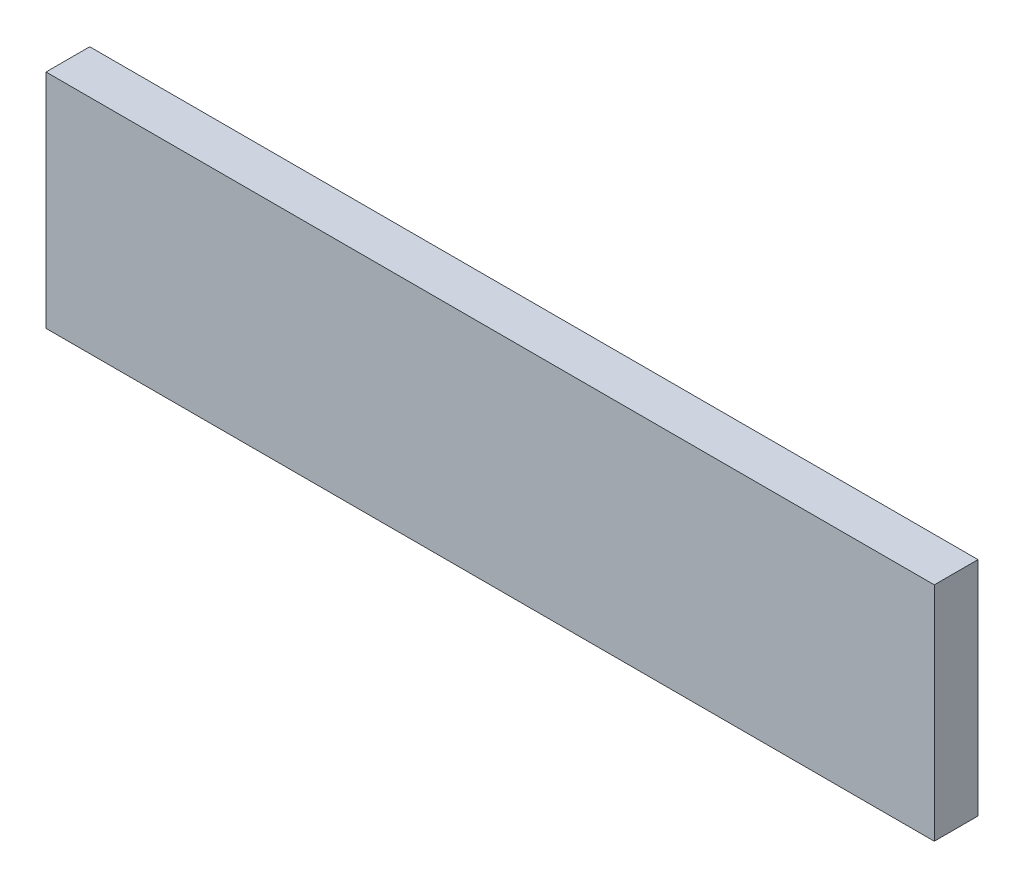
ISO-10303-21;
HEADER;
FILE_DESCRIPTION(('STEP AP214'),'2;1');
FILE_NAME('part.step','',(''),(''),'','','');
FILE_SCHEMA(('AUTOMOTIVE_DESIGN { 1 0 10303 214 1 1 1 1 }'));
ENDSEC;
DATA;
#1=APPLICATION_CONTEXT('core data for automotive mechanical design processes');
#2=APPLICATION_PROTOCOL_DEFINITION('international standard','automotive_design',2000,#1);
#3=PRODUCT_CONTEXT('',#1,'mechanical');
#4=PRODUCT('Part','Part','',(#3));
#5=PRODUCT_RELATED_PRODUCT_CATEGORY('part','',(#4));
#6=PRODUCT_DEFINITION_FORMATION('','',#4);
#7=PRODUCT_DEFINITION_CONTEXT('part definition',#1,'design');
#8=PRODUCT_DEFINITION('design','',#6,#7);
#9=PRODUCT_DEFINITION_SHAPE('','',#8);
#10=(LENGTH_UNIT() NAMED_UNIT(*) SI_UNIT(.MILLI.,.METRE.));
#11=(NAMED_UNIT(*) PLANE_ANGLE_UNIT() SI_UNIT($,.RADIAN.));
#12=(NAMED_UNIT(*) SI_UNIT($,.STERADIAN.) SOLID_ANGLE_UNIT());
#13=UNCERTAINTY_MEASURE_WITH_UNIT(LENGTH_MEASURE(1.E-05),#10,'distance_accuracy_value','');
#14=(GEOMETRIC_REPRESENTATION_CONTEXT(3) GLOBAL_UNCERTAINTY_ASSIGNED_CONTEXT((#13)) GLOBAL_UNIT_ASSIGNED_CONTEXT((#10,
#11,#12)) REPRESENTATION_CONTEXT('',''));
#15=CARTESIAN_POINT('',(0.,0.,0.));
#16=DIRECTION('',(0.,0.,1.));
#17=DIRECTION('',(1.,0.,0.));
#18=AXIS2_PLACEMENT_3D('',#15,#16,#17);
#19=CARTESIAN_POINT('',(-72.4758549021089,34.8924949638558,5.));
#20=DIRECTION('',(1.,0.,0.));
#21=DIRECTION('',(0.,0.,-1.));
#22=AXIS2_PLACEMENT_3D('',#19,#20,#21);
#23=PLANE('',#22);
#24=DIRECTION('',(0.,-1.,0.));
#25=VECTOR('',#24,1.);
#26=CARTESIAN_POINT('',(-72.4758549021089,34.8924949638558,0.));
#27=LINE('',#26,#25);
#28=CARTESIAN_POINT('',(-72.4758549021089,34.8924949638558,0.));
#29=VERTEX_POINT('',#28);
#30=CARTESIAN_POINT('',(-72.4758549021089,9.49249496385583,0.));
#31=VERTEX_POINT('',#30);
#32=EDGE_CURVE('E96',#29,#31,#27,.T.);
#33=ORIENTED_EDGE('',*,*,#32,.T.);
#34=DIRECTION('',(0.,0.,-1.));
#35=VECTOR('',#34,1.);
#36=CARTESIAN_POINT('',(-72.4758549021089,9.49249496385583,5.));
#37=LINE('',#36,#35);
#38=CARTESIAN_POINT('',(-72.4758549021089,9.49249496385583,5.));
#39=VERTEX_POINT('',#38);
#40=EDGE_CURVE('E11',#39,#31,#37,.T.);
#41=ORIENTED_EDGE('',*,*,#40,.F.);
#42=DIRECTION('',(0.,-1.,0.));
#43=VECTOR('',#42,1.);
#44=CARTESIAN_POINT('',(-72.4758549021089,34.8924949638558,5.));
#45=LINE('',#44,#43);
#46=CARTESIAN_POINT('',(-72.4758549021089,34.8924949638558,5.));
#47=VERTEX_POINT('',#46);
#48=EDGE_CURVE('E84',#47,#39,#45,.T.);
#49=ORIENTED_EDGE('',*,*,#48,.F.);
#50=DIRECTION('',(0.,0.,-1.));
#51=VECTOR('',#50,1.);
#52=CARTESIAN_POINT('',(-72.4758549021089,34.8924949638558,5.));
#53=LINE('',#52,#51);
#54=EDGE_CURVE('E92',#47,#29,#53,.T.);
#55=ORIENTED_EDGE('',*,*,#54,.T.);
#56=EDGE_LOOP('',(#33,#41,#49,#55));
#57=FACE_BOUND('',#56,.T.);
#58=ADVANCED_FACE('F33',(#57),#23,.F.);
#59=CARTESIAN_POINT('',(-72.4758549021089,9.49249496385583,5.));
#60=DIRECTION('',(0.,1.,0.));
#61=DIRECTION('',(0.,0.,1.));
#62=AXIS2_PLACEMENT_3D('',#59,#60,#61);
#63=PLANE('',#62);
#64=DIRECTION('',(1.,0.,0.));
#65=VECTOR('',#64,1.);
#66=CARTESIAN_POINT('',(-72.4758549021089,9.49249496385583,0.));
#67=LINE('',#66,#65);
#68=CARTESIAN_POINT('',(29.1241450978911,9.49249496385583,0.));
#69=VERTEX_POINT('',#68);
#70=EDGE_CURVE('E88',#31,#69,#67,.T.);
#71=ORIENTED_EDGE('',*,*,#70,.T.);
#72=DIRECTION('',(0.,0.,-1.));
#73=VECTOR('',#72,1.);
#74=CARTESIAN_POINT('',(29.1241450978911,9.49249496385583,5.));
#75=LINE('',#74,#73);
#76=CARTESIAN_POINT('',(29.1241450978911,9.49249496385583,5.));
#77=VERTEX_POINT('',#76);
#78=EDGE_CURVE('E41',#77,#69,#75,.T.);
#79=ORIENTED_EDGE('',*,*,#78,.F.);
#80=DIRECTION('',(1.,0.,0.));
#81=VECTOR('',#80,1.);
#82=CARTESIAN_POINT('',(-72.4758549021089,9.49249496385583,5.));
#83=LINE('',#82,#81);
#84=EDGE_CURVE('E79',#39,#77,#83,.T.);
#85=ORIENTED_EDGE('',*,*,#84,.F.);
#86=ORIENTED_EDGE('',*,*,#40,.T.);
#87=EDGE_LOOP('',(#71,#79,#85,#86));
#88=FACE_BOUND('',#87,.T.);
#89=ADVANCED_FACE('F87',(#88),#63,.F.);
#90=CARTESIAN_POINT('',(29.124145097891,34.8924949638558,5.));
#91=DIRECTION('',(-1.,0.,0.));
#92=DIRECTION('',(0.,-1.,0.));
#93=AXIS2_PLACEMENT_3D('',#90,#91,#92);
#94=PLANE('',#93);
#95=DIRECTION('',(0.,1.,0.));
#96=VECTOR('',#95,1.);
#97=CARTESIAN_POINT('',(29.124145097891,34.8924949638558,0.));
#98=LINE('',#97,#96);
#99=CARTESIAN_POINT('',(29.124145097891,34.8924949638558,0.));
#100=VERTEX_POINT('',#99);
#101=EDGE_CURVE('E66',#69,#100,#98,.T.);
#102=ORIENTED_EDGE('',*,*,#101,.T.);
#103=DIRECTION('',(0.,0.,-1.));
#104=VECTOR('',#103,1.);
#105=CARTESIAN_POINT('',(29.124145097891,34.8924949638558,5.));
#106=LINE('',#105,#104);
#107=CARTESIAN_POINT('',(29.124145097891,34.8924949638558,5.));
#108=VERTEX_POINT('',#107);
#109=EDGE_CURVE('E89',#108,#100,#106,.T.);
#110=ORIENTED_EDGE('',*,*,#109,.F.);
#111=DIRECTION('',(0.,1.,0.));
#112=VECTOR('',#111,1.);
#113=CARTESIAN_POINT('',(29.124145097891,34.8924949638558,5.));
#114=LINE('',#113,#112);
#115=EDGE_CURVE('E82',#77,#108,#114,.T.);
#116=ORIENTED_EDGE('',*,*,#115,.F.);
#117=ORIENTED_EDGE('',*,*,#78,.T.);
#118=EDGE_LOOP('',(#102,#110,#116,#117));
#119=FACE_BOUND('',#118,.T.);
#120=ADVANCED_FACE('F90',(#119),#94,.F.);
#121=CARTESIAN_POINT('',(-72.4758549021089,34.8924949638558,5.));
#122=DIRECTION('',(0.,-1.,0.));
#123=DIRECTION('',(0.,0.,-1.));
#124=AXIS2_PLACEMENT_3D('',#121,#122,#123);
#125=PLANE('',#124);
#126=DIRECTION('',(-1.,0.,0.));
#127=VECTOR('',#126,1.);
#128=CARTESIAN_POINT('',(-72.4758549021089,34.8924949638558,0.));
#129=LINE('',#128,#127);
#130=EDGE_CURVE('E72',#100,#29,#129,.T.);
#131=ORIENTED_EDGE('',*,*,#130,.T.);
#132=ORIENTED_EDGE('',*,*,#54,.F.);
#133=DIRECTION('',(-1.,0.,0.));
#134=VECTOR('',#133,1.);
#135=CARTESIAN_POINT('',(-72.4758549021089,34.8924949638558,5.));
#136=LINE('',#135,#134);
#137=EDGE_CURVE('E49',#108,#47,#136,.T.);
#138=ORIENTED_EDGE('',*,*,#137,.F.);
#139=ORIENTED_EDGE('',*,*,#109,.T.);
#140=EDGE_LOOP('',(#131,#132,#138,#139));
#141=FACE_BOUND('',#140,.T.);
#142=ADVANCED_FACE('F103',(#141),#125,.F.);
#143=CARTESIAN_POINT('',(0.,0.,5.));
#144=DIRECTION('',(0.,0.,1.));
#145=DIRECTION('',(1.,0.,0.));
#146=AXIS2_PLACEMENT_3D('',#143,#144,#145);
#147=PLANE('',#146);
#148=ORIENTED_EDGE('',*,*,#48,.T.);
#149=ORIENTED_EDGE('',*,*,#84,.T.);
#150=ORIENTED_EDGE('',*,*,#115,.T.);
#151=ORIENTED_EDGE('',*,*,#137,.T.);
#152=EDGE_LOOP('',(#148,#149,#150,#151));
#153=FACE_BOUND('',#152,.T.);
#154=ADVANCED_FACE('F80',(#153),#147,.T.);
#155=CARTESIAN_POINT('',(0.,0.,0.));
#156=DIRECTION('',(0.,0.,1.));
#157=DIRECTION('',(1.,0.,0.));
#158=AXIS2_PLACEMENT_3D('',#155,#156,#157);
#159=PLANE('',#158);
#160=ORIENTED_EDGE('',*,*,#32,.F.);
#161=ORIENTED_EDGE('',*,*,#130,.F.);
#162=ORIENTED_EDGE('',*,*,#101,.F.);
#163=ORIENTED_EDGE('',*,*,#70,.F.);
#164=EDGE_LOOP('',(#160,#161,#162,#163));
#165=FACE_BOUND('',#164,.T.);
#166=ADVANCED_FACE('F106',(#165),#159,.F.);
#167=CLOSED_SHELL('',(#58,#89,#120,#142,#154,#166));
#168=MANIFOLD_SOLID_BREP('B2',#167);
#169=ADVANCED_BREP_SHAPE_REPRESENTATION('',(#18,#168),#14);
#170=SHAPE_DEFINITION_REPRESENTATION(#9,#169);
ENDSEC;
END-ISO-10303-21;
